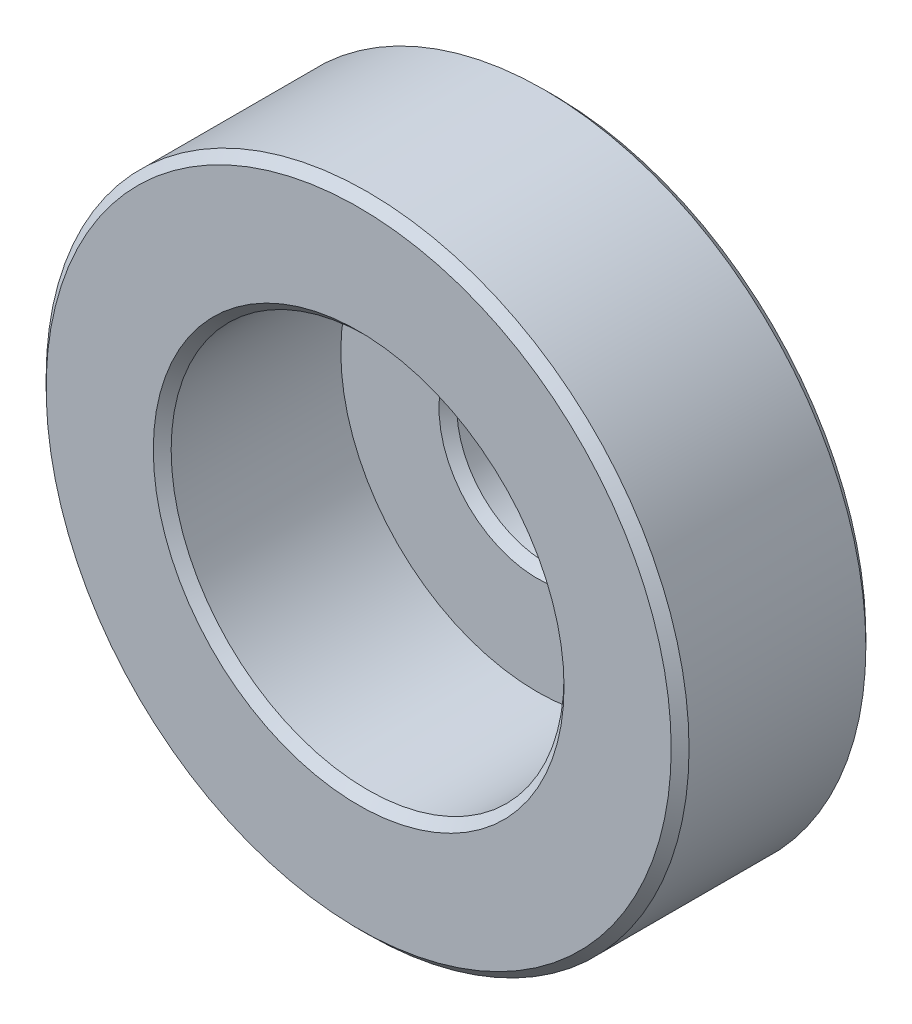
ISO-10303-21;
HEADER;
FILE_DESCRIPTION(('STEP AP214'),'2;1');
FILE_NAME('part.step','',(''),(''),'','','');
FILE_SCHEMA(('AUTOMOTIVE_DESIGN { 1 0 10303 214 1 1 1 1 }'));
ENDSEC;
DATA;
#1=APPLICATION_CONTEXT('core data for automotive mechanical design processes');
#2=APPLICATION_PROTOCOL_DEFINITION('international standard','automotive_design',2000,#1);
#3=PRODUCT_CONTEXT('',#1,'mechanical');
#4=PRODUCT('Part','Part','',(#3));
#5=PRODUCT_RELATED_PRODUCT_CATEGORY('part','',(#4));
#6=PRODUCT_DEFINITION_FORMATION('','',#4);
#7=PRODUCT_DEFINITION_CONTEXT('part definition',#1,'design');
#8=PRODUCT_DEFINITION('design','',#6,#7);
#9=PRODUCT_DEFINITION_SHAPE('','',#8);
#10=(LENGTH_UNIT() NAMED_UNIT(*) SI_UNIT(.MILLI.,.METRE.));
#11=(NAMED_UNIT(*) PLANE_ANGLE_UNIT() SI_UNIT($,.RADIAN.));
#12=(NAMED_UNIT(*) SI_UNIT($,.STERADIAN.) SOLID_ANGLE_UNIT());
#13=UNCERTAINTY_MEASURE_WITH_UNIT(LENGTH_MEASURE(1.E-05),#10,'distance_accuracy_value','');
#14=(GEOMETRIC_REPRESENTATION_CONTEXT(3) GLOBAL_UNCERTAINTY_ASSIGNED_CONTEXT((#13)) GLOBAL_UNIT_ASSIGNED_CONTEXT((#10,
#11,#12)) REPRESENTATION_CONTEXT('',''));
#15=CARTESIAN_POINT('',(0.,0.,0.));
#16=DIRECTION('',(0.,0.,1.));
#17=DIRECTION('',(1.,0.,0.));
#18=AXIS2_PLACEMENT_3D('',#15,#16,#17);
#19=CARTESIAN_POINT('',(-11.,0.,0.));
#20=DIRECTION('',(0.,0.,-1.));
#21=DIRECTION('',(-1.,0.,0.));
#22=AXIS2_PLACEMENT_3D('',#19,#20,#21);
#23=PLANE('',#22);
#24=DIRECTION('',(0.,1.,0.));
#25=VECTOR('',#24,1.);
#26=CARTESIAN_POINT('',(-1.25,-4.84122918275927,0.));
#27=LINE('',#26,#25);
#28=CARTESIAN_POINT('',(-1.25,-10.4253297309965,0.));
#29=VERTEX_POINT('',#28);
#30=CARTESIAN_POINT('',(-1.25,-4.84122918275927,0.));
#31=VERTEX_POINT('',#30);
#32=EDGE_CURVE('E133',#29,#31,#27,.T.);
#33=ORIENTED_EDGE('',*,*,#32,.F.);
#34=CARTESIAN_POINT('',(0.,0.,0.));
#35=DIRECTION('',(0.,0.,-1.));
#36=DIRECTION('',(-1.,0.,0.));
#37=AXIS2_PLACEMENT_3D('',#34,#35,#36);
#38=CIRCLE('',#37,10.5);
#39=CARTESIAN_POINT('',(-1.25,10.4253297309965,0.));
#40=VERTEX_POINT('',#39);
#41=EDGE_CURVE('E209',#29,#40,#38,.T.);
#42=ORIENTED_EDGE('',*,*,#41,.T.);
#43=DIRECTION('',(0.,1.,0.));
#44=VECTOR('',#43,1.);
#45=CARTESIAN_POINT('',(-1.25,10.9409689664164,0.));
#46=LINE('',#45,#44);
#47=CARTESIAN_POINT('',(-1.25,4.84122918275927,0.));
#48=VERTEX_POINT('',#47);
#49=EDGE_CURVE('E142',#48,#40,#46,.T.);
#50=ORIENTED_EDGE('',*,*,#49,.F.);
#51=CARTESIAN_POINT('',(0.,0.,0.));
#52=DIRECTION('',(0.,0.,-1.));
#53=DIRECTION('',(-1.,0.,0.));
#54=AXIS2_PLACEMENT_3D('',#51,#52,#53);
#55=CIRCLE('',#54,5.);
#56=EDGE_CURVE('E167',#31,#48,#55,.T.);
#57=ORIENTED_EDGE('',*,*,#56,.F.);
#58=EDGE_LOOP('',(#33,#42,#50,#57));
#59=FACE_BOUND('',#58,.T.);
#60=ADVANCED_FACE('F32',(#59),#23,.T.);
#61=CARTESIAN_POINT('',(-18.,0.,15.4));
#62=DIRECTION('',(0.,0.,1.));
#63=DIRECTION('',(1.,0.,0.));
#64=AXIS2_PLACEMENT_3D('',#61,#62,#63);
#65=PLANE('',#64);
#66=CARTESIAN_POINT('',(0.,0.,15.4));
#67=DIRECTION('',(0.,0.,1.));
#68=DIRECTION('',(1.,0.,0.));
#69=AXIS2_PLACEMENT_3D('',#66,#67,#68);
#70=CIRCLE('',#69,11.5);
#71=CARTESIAN_POINT('',(11.5,0.,15.4));
#72=VERTEX_POINT('',#71);
#73=EDGE_CURVE('E194',#72,#72,#70,.F.);
#74=ORIENTED_EDGE('',*,*,#73,.T.);
#75=EDGE_LOOP('',(#74));
#76=FACE_BOUND('',#75,.T.);
#77=CARTESIAN_POINT('',(0.,0.,15.4));
#78=DIRECTION('',(0.,0.,1.));
#79=DIRECTION('',(1.,0.,0.));
#80=AXIS2_PLACEMENT_3D('',#77,#78,#79);
#81=CIRCLE('',#80,17.5);
#82=CARTESIAN_POINT('',(17.5,0.,15.4));
#83=VERTEX_POINT('',#82);
#84=EDGE_CURVE('E191',#83,#83,#81,.T.);
#85=ORIENTED_EDGE('',*,*,#84,.T.);
#86=EDGE_LOOP('',(#85));
#87=FACE_BOUND('',#86,.T.);
#88=ADVANCED_FACE('F259',(#76,#87),#65,.T.);
#89=CARTESIAN_POINT('',(0.,0.,0.));
#90=DIRECTION('',(0.,0.,-1.));
#91=DIRECTION('',(-1.,0.,0.));
#92=AXIS2_PLACEMENT_3D('',#89,#90,#91);
#93=CYLINDRICAL_SURFACE('',#92,11.);
#94=CARTESIAN_POINT('',(0.,0.,14.9));
#95=DIRECTION('',(0.,0.,1.));
#96=DIRECTION('',(1.,0.,0.));
#97=AXIS2_PLACEMENT_3D('',#94,#95,#96);
#98=CIRCLE('',#97,11.);
#99=CARTESIAN_POINT('',(11.,0.,14.9));
#100=VERTEX_POINT('',#99);
#101=EDGE_CURVE('E197',#100,#100,#98,.T.);
#102=ORIENTED_EDGE('',*,*,#101,.T.);
#103=EDGE_LOOP('',(#102));
#104=FACE_BOUND('',#103,.T.);
#105=CARTESIAN_POINT('',(0.,0.,5.4));
#106=DIRECTION('',(0.,0.,-1.));
#107=DIRECTION('',(-1.,0.,0.));
#108=AXIS2_PLACEMENT_3D('',#105,#106,#107);
#109=CIRCLE('',#108,11.);
#110=CARTESIAN_POINT('',(-11.,0.,5.4));
#111=VERTEX_POINT('',#110);
#112=EDGE_CURVE('E169',#111,#111,#109,.T.);
#113=ORIENTED_EDGE('',*,*,#112,.T.);
#114=EDGE_LOOP('',(#113));
#115=FACE_BOUND('',#114,.T.);
#116=ADVANCED_FACE('F255',(#104,#115),#93,.F.);
#117=CARTESIAN_POINT('',(-11.,0.,5.4));
#118=DIRECTION('',(0.,0.,1.));
#119=DIRECTION('',(1.,0.,0.));
#120=AXIS2_PLACEMENT_3D('',#117,#118,#119);
#121=PLANE('',#120);
#122=CARTESIAN_POINT('',(0.,0.,5.4));
#123=DIRECTION('',(0.,0.,1.));
#124=DIRECTION('',(1.,0.,0.));
#125=AXIS2_PLACEMENT_3D('',#122,#123,#124);
#126=CIRCLE('',#125,5.49999999999998);
#127=CARTESIAN_POINT('',(5.49999999999999,0.,5.4));
#128=VERTEX_POINT('',#127);
#129=EDGE_CURVE('E185',#128,#128,#126,.F.);
#130=ORIENTED_EDGE('',*,*,#129,.T.);
#131=EDGE_LOOP('',(#130));
#132=FACE_BOUND('',#131,.T.);
#133=ORIENTED_EDGE('',*,*,#112,.F.);
#134=EDGE_LOOP('',(#133));
#135=FACE_BOUND('',#134,.T.);
#136=ADVANCED_FACE('F251',(#132,#135),#121,.T.);
#137=CARTESIAN_POINT('',(0.,0.,0.));
#138=DIRECTION('',(0.,0.,-1.));
#139=DIRECTION('',(-1.,0.,0.));
#140=AXIS2_PLACEMENT_3D('',#137,#138,#139);
#141=CYLINDRICAL_SURFACE('',#140,5.);
#142=CARTESIAN_POINT('',(0.,0.,4.90000000000001));
#143=DIRECTION('',(0.,0.,1.));
#144=DIRECTION('',(1.,0.,0.));
#145=AXIS2_PLACEMENT_3D('',#142,#143,#144);
#146=CIRCLE('',#145,5.);
#147=CARTESIAN_POINT('',(5.,0.,4.90000000000001));
#148=VERTEX_POINT('',#147);
#149=EDGE_CURVE('E188',#148,#148,#146,.T.);
#150=ORIENTED_EDGE('',*,*,#149,.T.);
#151=EDGE_LOOP('',(#150));
#152=FACE_BOUND('',#151,.T.);
#153=DIRECTION('',(0.,0.,-1.));
#154=VECTOR('',#153,1.);
#155=CARTESIAN_POINT('',(-1.25,-4.84122918275927,1.5));
#156=LINE('',#155,#154);
#157=CARTESIAN_POINT('',(-1.25,-4.84122918275927,1.5));
#158=VERTEX_POINT('',#157);
#159=EDGE_CURVE('E140',#158,#31,#156,.T.);
#160=ORIENTED_EDGE('',*,*,#159,.T.);
#161=ORIENTED_EDGE('',*,*,#56,.T.);
#162=DIRECTION('',(0.,0.,-1.));
#163=VECTOR('',#162,1.);
#164=CARTESIAN_POINT('',(-1.25,4.84122918275927,1.5));
#165=LINE('',#164,#163);
#166=CARTESIAN_POINT('',(-1.25,4.84122918275927,1.5));
#167=VERTEX_POINT('',#166);
#168=EDGE_CURVE('E156',#167,#48,#165,.T.);
#169=ORIENTED_EDGE('',*,*,#168,.F.);
#170=CARTESIAN_POINT('',(0.,0.,1.5));
#171=DIRECTION('',(0.,0.,1.));
#172=DIRECTION('',(-1.,0.,0.));
#173=AXIS2_PLACEMENT_3D('',#170,#171,#172);
#174=CIRCLE('',#173,5.);
#175=CARTESIAN_POINT('',(1.25,4.84122918275927,1.5));
#176=VERTEX_POINT('',#175);
#177=EDGE_CURVE('E147',#176,#167,#174,.T.);
#178=ORIENTED_EDGE('',*,*,#177,.F.);
#179=DIRECTION('',(0.,0.,-1.));
#180=VECTOR('',#179,1.);
#181=CARTESIAN_POINT('',(1.25,4.84122918275927,1.5));
#182=LINE('',#181,#180);
#183=CARTESIAN_POINT('',(1.25,4.84122918275927,0.));
#184=VERTEX_POINT('',#183);
#185=EDGE_CURVE('E160',#176,#184,#182,.T.);
#186=ORIENTED_EDGE('',*,*,#185,.T.);
#187=CARTESIAN_POINT('',(1.25,-4.84122918275927,0.));
#188=VERTEX_POINT('',#187);
#189=EDGE_CURVE('E139',#184,#188,#55,.T.);
#190=ORIENTED_EDGE('',*,*,#189,.T.);
#191=DIRECTION('',(0.,0.,-1.));
#192=VECTOR('',#191,1.);
#193=CARTESIAN_POINT('',(1.25,-4.84122918275927,1.5));
#194=LINE('',#193,#192);
#195=CARTESIAN_POINT('',(1.25,-4.84122918275927,1.5));
#196=VERTEX_POINT('',#195);
#197=EDGE_CURVE('E118',#196,#188,#194,.T.);
#198=ORIENTED_EDGE('',*,*,#197,.F.);
#199=CARTESIAN_POINT('',(0.,0.,1.5));
#200=DIRECTION('',(0.,0.,1.));
#201=DIRECTION('',(-1.,0.,0.));
#202=AXIS2_PLACEMENT_3D('',#199,#200,#201);
#203=CIRCLE('',#202,5.);
#204=EDGE_CURVE('E125',#158,#196,#203,.T.);
#205=ORIENTED_EDGE('',*,*,#204,.F.);
#206=EDGE_LOOP('',(#160,#161,#169,#178,#186,#190,#198,#205));
#207=FACE_BOUND('',#206,.T.);
#208=ADVANCED_FACE('F136',(#152,#207),#141,.F.);
#209=DIRECTION('',(0.,-1.,0.));
#210=VECTOR('',#209,1.);
#211=CARTESIAN_POINT('',(1.25,10.9409689664164,0.));
#212=LINE('',#211,#210);
#213=CARTESIAN_POINT('',(1.25,10.4253297309965,0.));
#214=VERTEX_POINT('',#213);
#215=EDGE_CURVE('E151',#214,#184,#212,.T.);
#216=ORIENTED_EDGE('',*,*,#215,.F.);
#217=CARTESIAN_POINT('',(0.,0.,0.));
#218=DIRECTION('',(0.,0.,-1.));
#219=DIRECTION('',(-1.,0.,0.));
#220=AXIS2_PLACEMENT_3D('',#217,#218,#219);
#221=CIRCLE('',#220,10.5);
#222=CARTESIAN_POINT('',(1.25,-10.4253297309965,0.));
#223=VERTEX_POINT('',#222);
#224=EDGE_CURVE('E308',#214,#223,#221,.T.);
#225=ORIENTED_EDGE('',*,*,#224,.T.);
#226=DIRECTION('',(0.,-1.,0.));
#227=VECTOR('',#226,1.);
#228=CARTESIAN_POINT('',(1.25,-4.84122918275927,0.));
#229=LINE('',#228,#227);
#230=EDGE_CURVE('E293',#188,#223,#229,.T.);
#231=ORIENTED_EDGE('',*,*,#230,.F.);
#232=ORIENTED_EDGE('',*,*,#189,.F.);
#233=EDGE_LOOP('',(#216,#225,#231,#232));
#234=FACE_BOUND('',#233,.T.);
#235=ADVANCED_FACE('F244',(#234),#23,.T.);
#236=CARTESIAN_POINT('',(0.,0.,0.));
#237=DIRECTION('',(0.,0.,-1.));
#238=DIRECTION('',(-1.,0.,0.));
#239=AXIS2_PLACEMENT_3D('',#236,#237,#238);
#240=CYLINDRICAL_SURFACE('',#239,11.);
#241=DIRECTION('',(0.,0.,-1.));
#242=VECTOR('',#241,1.);
#243=CARTESIAN_POINT('',(-1.25,10.9287464971972,0.));
#244=LINE('',#243,#242);
#245=CARTESIAN_POINT('',(-1.25,10.9287464971972,0.499999999999997));
#246=VERTEX_POINT('',#245);
#247=CARTESIAN_POINT('',(-1.25,10.9287464971972,1.5));
#248=VERTEX_POINT('',#247);
#249=EDGE_CURVE('E175',#246,#248,#244,.F.);
#250=ORIENTED_EDGE('',*,*,#249,.F.);
#251=CARTESIAN_POINT('',(0.,0.,0.499999999999997));
#252=DIRECTION('',(0.,0.,-1.));
#253=DIRECTION('',(-1.,0.,0.));
#254=AXIS2_PLACEMENT_3D('',#251,#252,#253);
#255=CIRCLE('',#254,11.);
#256=CARTESIAN_POINT('',(-1.25,-10.9287464971972,0.499999999999997));
#257=VERTEX_POINT('',#256);
#258=EDGE_CURVE('E297',#246,#257,#255,.F.);
#259=ORIENTED_EDGE('',*,*,#258,.T.);
#260=DIRECTION('',(0.,0.,-1.));
#261=VECTOR('',#260,1.);
#262=CARTESIAN_POINT('',(-1.25,-10.9287464971972,0.));
#263=LINE('',#262,#261);
#264=CARTESIAN_POINT('',(-1.25,-10.9287464971972,1.5));
#265=VERTEX_POINT('',#264);
#266=EDGE_CURVE('E182',#265,#257,#263,.T.);
#267=ORIENTED_EDGE('',*,*,#266,.F.);
#268=CARTESIAN_POINT('',(0.,0.,1.5));
#269=DIRECTION('',(0.,0.,-1.));
#270=DIRECTION('',(-1.,0.,0.));
#271=AXIS2_PLACEMENT_3D('',#268,#269,#270);
#272=CIRCLE('',#271,11.);
#273=CARTESIAN_POINT('',(1.25,-10.9287464971972,1.5));
#274=VERTEX_POINT('',#273);
#275=EDGE_CURVE('E179',#265,#274,#272,.F.);
#276=ORIENTED_EDGE('',*,*,#275,.T.);
#277=DIRECTION('',(0.,0.,-1.));
#278=VECTOR('',#277,1.);
#279=CARTESIAN_POINT('',(1.25,-10.9287464971972,0.));
#280=LINE('',#279,#278);
#281=CARTESIAN_POINT('',(1.25,-10.9287464971972,0.5));
#282=VERTEX_POINT('',#281);
#283=EDGE_CURVE('E121',#282,#274,#280,.F.);
#284=ORIENTED_EDGE('',*,*,#283,.F.);
#285=CARTESIAN_POINT('',(0.,0.,0.500000000000001));
#286=DIRECTION('',(0.,0.,-1.));
#287=DIRECTION('',(-1.,0.,0.));
#288=AXIS2_PLACEMENT_3D('',#285,#286,#287);
#289=CIRCLE('',#288,11.);
#290=CARTESIAN_POINT('',(1.25,10.9287464971972,0.5));
#291=VERTEX_POINT('',#290);
#292=EDGE_CURVE('E219',#282,#291,#289,.F.);
#293=ORIENTED_EDGE('',*,*,#292,.T.);
#294=DIRECTION('',(0.,0.,-1.));
#295=VECTOR('',#294,1.);
#296=CARTESIAN_POINT('',(1.25,10.9287464971972,0.));
#297=LINE('',#296,#295);
#298=CARTESIAN_POINT('',(1.25,10.9287464971972,1.5));
#299=VERTEX_POINT('',#298);
#300=EDGE_CURVE('E177',#299,#291,#297,.T.);
#301=ORIENTED_EDGE('',*,*,#300,.F.);
#302=CARTESIAN_POINT('',(0.,0.,1.5));
#303=DIRECTION('',(0.,0.,-1.));
#304=DIRECTION('',(-1.,0.,0.));
#305=AXIS2_PLACEMENT_3D('',#302,#303,#304);
#306=CIRCLE('',#305,11.);
#307=EDGE_CURVE('E172',#299,#248,#306,.F.);
#308=ORIENTED_EDGE('',*,*,#307,.T.);
#309=EDGE_LOOP('',(#250,#259,#267,#276,#284,#293,#301,#308));
#310=FACE_BOUND('',#309,.T.);
#311=CARTESIAN_POINT('',(0.,0.,4.5));
#312=DIRECTION('',(0.,0.,-1.));
#313=DIRECTION('',(-1.,0.,0.));
#314=AXIS2_PLACEMENT_3D('',#311,#312,#313);
#315=CIRCLE('',#314,11.);
#316=CARTESIAN_POINT('',(-11.,0.,4.5));
#317=VERTEX_POINT('',#316);
#318=EDGE_CURVE('E162',#317,#317,#315,.T.);
#319=ORIENTED_EDGE('',*,*,#318,.T.);
#320=EDGE_LOOP('',(#319));
#321=FACE_BOUND('',#320,.T.);
#322=ADVANCED_FACE('F240',(#310,#321),#240,.T.);
#323=CARTESIAN_POINT('',(-18.,0.,4.5));
#324=DIRECTION('',(0.,0.,-1.));
#325=DIRECTION('',(-1.,0.,0.));
#326=AXIS2_PLACEMENT_3D('',#323,#324,#325);
#327=PLANE('',#326);
#328=CARTESIAN_POINT('',(0.,0.,4.5));
#329=DIRECTION('',(0.,0.,-1.));
#330=DIRECTION('',(-1.,0.,0.));
#331=AXIS2_PLACEMENT_3D('',#328,#329,#330);
#332=CIRCLE('',#331,17.5);
#333=CARTESIAN_POINT('',(-17.5,0.,4.5));
#334=VERTEX_POINT('',#333);
#335=EDGE_CURVE('E206',#334,#334,#332,.T.);
#336=ORIENTED_EDGE('',*,*,#335,.T.);
#337=EDGE_LOOP('',(#336));
#338=FACE_BOUND('',#337,.T.);
#339=ORIENTED_EDGE('',*,*,#318,.F.);
#340=EDGE_LOOP('',(#339));
#341=FACE_BOUND('',#340,.T.);
#342=ADVANCED_FACE('F236',(#338,#341),#327,.T.);
#343=CARTESIAN_POINT('',(0.,0.,0.));
#344=DIRECTION('',(0.,0.,-1.));
#345=DIRECTION('',(-1.,0.,0.));
#346=AXIS2_PLACEMENT_3D('',#343,#344,#345);
#347=CYLINDRICAL_SURFACE('',#346,18.);
#348=CARTESIAN_POINT('',(0.,0.,14.9));
#349=DIRECTION('',(0.,0.,1.));
#350=DIRECTION('',(1.,0.,0.));
#351=AXIS2_PLACEMENT_3D('',#348,#349,#350);
#352=CIRCLE('',#351,18.);
#353=CARTESIAN_POINT('',(18.,0.,14.9));
#354=VERTEX_POINT('',#353);
#355=EDGE_CURVE('E203',#354,#354,#352,.F.);
#356=ORIENTED_EDGE('',*,*,#355,.T.);
#357=EDGE_LOOP('',(#356));
#358=FACE_BOUND('',#357,.T.);
#359=CARTESIAN_POINT('',(0.,0.,4.99999999999999));
#360=DIRECTION('',(0.,0.,-1.));
#361=DIRECTION('',(-1.,0.,0.));
#362=AXIS2_PLACEMENT_3D('',#359,#360,#361);
#363=CIRCLE('',#362,18.);
#364=CARTESIAN_POINT('',(-18.,0.,4.99999999999999));
#365=VERTEX_POINT('',#364);
#366=EDGE_CURVE('E200',#365,#365,#363,.F.);
#367=ORIENTED_EDGE('',*,*,#366,.T.);
#368=EDGE_LOOP('',(#367));
#369=FACE_BOUND('',#368,.T.);
#370=ADVANCED_FACE('F233',(#358,#369),#347,.T.);
#371=CARTESIAN_POINT('',(1.25,10.9409689664164,1.5));
#372=DIRECTION('',(1.,0.,0.));
#373=DIRECTION('',(0.,0.,-1.));
#374=AXIS2_PLACEMENT_3D('',#371,#372,#373);
#375=PLANE('',#374);
#376=ORIENTED_EDGE('',*,*,#300,.T.);
#377=CARTESIAN_POINT('',(1.25,10.9287464971972,0.5));
#378=CARTESIAN_POINT('',(1.25,10.8448569910639,0.416653287652448));
#379=CARTESIAN_POINT('',(1.25,10.76096084082,0.333313264818164));
#380=CARTESIAN_POINT('',(1.25,10.5931552520865,0.166646598151493));
#381=CARTESIAN_POINT('',(1.25,10.5092458135968,0.0833199543191108));
#382=CARTESIAN_POINT('',(1.25,10.4253297309965,0.));
#383=B_SPLINE_CURVE_WITH_KNOTS('',3,(#377,#378,#379,#380,#381,#382),.UNSPECIFIED.,.F.,.F.,(4,2,
4),(0.,0.354763457652868,0.709526915410628),.UNSPECIFIED.);
#384=EDGE_CURVE('E11',#291,#214,#383,.T.);
#385=ORIENTED_EDGE('',*,*,#384,.T.);
#386=ORIENTED_EDGE('',*,*,#215,.T.);
#387=ORIENTED_EDGE('',*,*,#185,.F.);
#388=DIRECTION('',(0.,-1.,0.));
#389=VECTOR('',#388,1.);
#390=CARTESIAN_POINT('',(1.25,10.9409689664164,1.5));
#391=LINE('',#390,#389);
#392=EDGE_CURVE('E154',#299,#176,#391,.T.);
#393=ORIENTED_EDGE('',*,*,#392,.F.);
#394=EDGE_LOOP('',(#376,#385,#386,#387,#393));
#395=FACE_BOUND('',#394,.T.);
#396=ADVANCED_FACE('F229',(#395),#375,.F.);
#397=CARTESIAN_POINT('',(-1.25,10.9409689664164,1.5));
#398=DIRECTION('',(-1.,0.,0.));
#399=DIRECTION('',(0.,0.,1.));
#400=AXIS2_PLACEMENT_3D('',#397,#398,#399);
#401=PLANE('',#400);
#402=ORIENTED_EDGE('',*,*,#49,.T.);
#403=CARTESIAN_POINT('',(-1.25,10.4253297309965,0.));
#404=CARTESIAN_POINT('',(-1.25,10.5092458135968,0.0833199543191108));
#405=CARTESIAN_POINT('',(-1.25,10.5931552520865,0.166646598151493));
#406=CARTESIAN_POINT('',(-1.25,10.76096084082,0.333313264818163));
#407=CARTESIAN_POINT('',(-1.25,10.8448569910639,0.416653287652446));
#408=CARTESIAN_POINT('',(-1.25,10.9287464971972,0.499999999999997));
#409=B_SPLINE_CURVE_WITH_KNOTS('',3,(#403,#404,#405,#406,#407,#408),.UNSPECIFIED.,.F.,.F.,(4,2,
4),(0.,0.354763457757757,0.709526915410622),.UNSPECIFIED.);
#410=EDGE_CURVE('E212',#40,#246,#409,.T.);
#411=ORIENTED_EDGE('',*,*,#410,.T.);
#412=ORIENTED_EDGE('',*,*,#249,.T.);
#413=DIRECTION('',(0.,1.,0.));
#414=VECTOR('',#413,1.);
#415=CARTESIAN_POINT('',(-1.25,10.9409689664164,1.5));
#416=LINE('',#415,#414);
#417=EDGE_CURVE('E150',#167,#248,#416,.T.);
#418=ORIENTED_EDGE('',*,*,#417,.F.);
#419=ORIENTED_EDGE('',*,*,#168,.T.);
#420=EDGE_LOOP('',(#402,#411,#412,#418,#419));
#421=FACE_BOUND('',#420,.T.);
#422=ADVANCED_FACE('F224',(#421),#401,.F.);
#423=CARTESIAN_POINT('',(0.,0.,1.5));
#424=DIRECTION('',(0.,0.,-1.));
#425=DIRECTION('',(-1.,0.,0.));
#426=AXIS2_PLACEMENT_3D('',#423,#424,#425);
#427=PLANE('',#426);
#428=ORIENTED_EDGE('',*,*,#392,.T.);
#429=ORIENTED_EDGE('',*,*,#177,.T.);
#430=ORIENTED_EDGE('',*,*,#417,.T.);
#431=ORIENTED_EDGE('',*,*,#307,.F.);
#432=EDGE_LOOP('',(#428,#429,#430,#431));
#433=FACE_BOUND('',#432,.T.);
#434=ADVANCED_FACE('F228',(#433),#427,.T.);
#435=CARTESIAN_POINT('',(-1.25,-4.84122918275927,1.5));
#436=DIRECTION('',(-1.,0.,0.));
#437=DIRECTION('',(0.,0.,1.));
#438=AXIS2_PLACEMENT_3D('',#435,#436,#437);
#439=PLANE('',#438);
#440=ORIENTED_EDGE('',*,*,#266,.T.);
#441=CARTESIAN_POINT('',(-1.25,-10.9287464971972,0.499999999999997));
#442=CARTESIAN_POINT('',(-1.25,-10.8448569910639,0.416653287652446));
#443=CARTESIAN_POINT('',(-1.25,-10.76096084082,0.333313264818162));
#444=CARTESIAN_POINT('',(-1.25,-10.5931552520865,0.166646598151493));
#445=CARTESIAN_POINT('',(-1.25,-10.5092458135968,0.0833199543191116));
#446=CARTESIAN_POINT('',(-1.25,-10.4253297309965,0.));
#447=B_SPLINE_CURVE_WITH_KNOTS('',3,(#441,#442,#443,#444,#445,#446),.UNSPECIFIED.,.F.,.F.,(4,2,
4),(0.,0.354763457652867,0.709526915410622),.UNSPECIFIED.);
#448=EDGE_CURVE('E296',#257,#29,#447,.T.);
#449=ORIENTED_EDGE('',*,*,#448,.T.);
#450=ORIENTED_EDGE('',*,*,#32,.T.);
#451=ORIENTED_EDGE('',*,*,#159,.F.);
#452=DIRECTION('',(0.,1.,0.));
#453=VECTOR('',#452,1.);
#454=CARTESIAN_POINT('',(-1.25,-4.84122918275927,1.5));
#455=LINE('',#454,#453);
#456=EDGE_CURVE('E124',#265,#158,#455,.T.);
#457=ORIENTED_EDGE('',*,*,#456,.F.);
#458=EDGE_LOOP('',(#440,#449,#450,#451,#457));
#459=FACE_BOUND('',#458,.T.);
#460=ADVANCED_FACE('F307',(#459),#439,.F.);
#461=CARTESIAN_POINT('',(1.25,-4.84122918275927,1.5));
#462=DIRECTION('',(1.,0.,0.));
#463=DIRECTION('',(0.,0.,-1.));
#464=AXIS2_PLACEMENT_3D('',#461,#462,#463);
#465=PLANE('',#464);
#466=ORIENTED_EDGE('',*,*,#230,.T.);
#467=CARTESIAN_POINT('',(1.25,-10.4253297309965,0.));
#468=CARTESIAN_POINT('',(1.25,-10.5092458135968,0.0833199543191107));
#469=CARTESIAN_POINT('',(1.25,-10.5931552520865,0.166646598151493));
#470=CARTESIAN_POINT('',(1.25,-10.76096084082,0.333313264818164));
#471=CARTESIAN_POINT('',(1.25,-10.8448569910639,0.416653287652448));
#472=CARTESIAN_POINT('',(1.25,-10.9287464971972,0.5));
#473=B_SPLINE_CURVE_WITH_KNOTS('',3,(#467,#468,#469,#470,#471,#472),.UNSPECIFIED.,.F.,.F.,(4,2,
4),(0.,0.35476345775776,0.709526915410629),.UNSPECIFIED.);
#474=EDGE_CURVE('E46',#223,#282,#473,.T.);
#475=ORIENTED_EDGE('',*,*,#474,.T.);
#476=ORIENTED_EDGE('',*,*,#283,.T.);
#477=DIRECTION('',(0.,-1.,0.));
#478=VECTOR('',#477,1.);
#479=CARTESIAN_POINT('',(1.25,-4.84122918275927,1.5));
#480=LINE('',#479,#478);
#481=EDGE_CURVE('E113',#196,#274,#480,.T.);
#482=ORIENTED_EDGE('',*,*,#481,.F.);
#483=ORIENTED_EDGE('',*,*,#197,.T.);
#484=EDGE_LOOP('',(#466,#475,#476,#482,#483));
#485=FACE_BOUND('',#484,.T.);
#486=ADVANCED_FACE('F116',(#485),#465,.F.);
#487=CARTESIAN_POINT('',(0.,0.,1.5));
#488=DIRECTION('',(0.,0.,-1.));
#489=DIRECTION('',(-1.,0.,0.));
#490=AXIS2_PLACEMENT_3D('',#487,#488,#489);
#491=PLANE('',#490);
#492=ORIENTED_EDGE('',*,*,#456,.T.);
#493=ORIENTED_EDGE('',*,*,#204,.T.);
#494=ORIENTED_EDGE('',*,*,#481,.T.);
#495=ORIENTED_EDGE('',*,*,#275,.F.);
#496=EDGE_LOOP('',(#492,#493,#494,#495));
#497=FACE_BOUND('',#496,.T.);
#498=ADVANCED_FACE('F128',(#497),#491,.T.);
#499=CARTESIAN_POINT('',(0.,0.,5.4));
#500=DIRECTION('',(0.,0.,1.));
#501=DIRECTION('',(1.,0.,0.));
#502=AXIS2_PLACEMENT_3D('',#499,#500,#501);
#503=CONICAL_SURFACE('',#502,5.49999999999998,0.785398163397444);
#504=ORIENTED_EDGE('',*,*,#149,.F.);
#505=EDGE_LOOP('',(#504));
#506=FACE_BOUND('',#505,.T.);
#507=ORIENTED_EDGE('',*,*,#129,.F.);
#508=EDGE_LOOP('',(#507));
#509=FACE_BOUND('',#508,.T.);
#510=ADVANCED_FACE('F264',(#506,#509),#503,.F.);
#511=CARTESIAN_POINT('',(0.,0.,15.4));
#512=DIRECTION('',(0.,0.,1.));
#513=DIRECTION('',(1.,0.,0.));
#514=AXIS2_PLACEMENT_3D('',#511,#512,#513);
#515=CONICAL_SURFACE('',#514,11.5,0.785398163397445);
#516=ORIENTED_EDGE('',*,*,#101,.F.);
#517=EDGE_LOOP('',(#516));
#518=FACE_BOUND('',#517,.T.);
#519=ORIENTED_EDGE('',*,*,#73,.F.);
#520=EDGE_LOOP('',(#519));
#521=FACE_BOUND('',#520,.T.);
#522=ADVANCED_FACE('F267',(#518,#521),#515,.F.);
#523=CARTESIAN_POINT('',(0.,0.,14.9));
#524=DIRECTION('',(0.,0.,-1.));
#525=DIRECTION('',(-1.,0.,0.));
#526=AXIS2_PLACEMENT_3D('',#523,#524,#525);
#527=CONICAL_SURFACE('',#526,18.,0.785398163397452);
#528=ORIENTED_EDGE('',*,*,#84,.F.);
#529=EDGE_LOOP('',(#528));
#530=FACE_BOUND('',#529,.T.);
#531=ORIENTED_EDGE('',*,*,#355,.F.);
#532=EDGE_LOOP('',(#531));
#533=FACE_BOUND('',#532,.T.);
#534=ADVANCED_FACE('F271',(#530,#533),#527,.T.);
#535=CARTESIAN_POINT('',(0.,0.,4.5));
#536=DIRECTION('',(0.,0.,1.));
#537=DIRECTION('',(1.,0.,0.));
#538=AXIS2_PLACEMENT_3D('',#535,#536,#537);
#539=CONICAL_SURFACE('',#538,17.5,0.785398163397452);
#540=ORIENTED_EDGE('',*,*,#366,.F.);
#541=EDGE_LOOP('',(#540));
#542=FACE_BOUND('',#541,.T.);
#543=ORIENTED_EDGE('',*,*,#335,.F.);
#544=EDGE_LOOP('',(#543));
#545=FACE_BOUND('',#544,.T.);
#546=ADVANCED_FACE('F274',(#542,#545),#539,.T.);
#547=CARTESIAN_POINT('',(0.,0.,0.));
#548=DIRECTION('',(0.,0.,1.));
#549=DIRECTION('',(1.,0.,0.));
#550=AXIS2_PLACEMENT_3D('',#547,#548,#549);
#551=CONICAL_SURFACE('',#550,10.5,0.785398163397447);
#552=ORIENTED_EDGE('',*,*,#448,.F.);
#553=ORIENTED_EDGE('',*,*,#258,.F.);
#554=ORIENTED_EDGE('',*,*,#410,.F.);
#555=ORIENTED_EDGE('',*,*,#41,.F.);
#556=EDGE_LOOP('',(#552,#553,#554,#555));
#557=FACE_BOUND('',#556,.T.);
#558=ADVANCED_FACE('F221',(#557),#551,.T.);
#559=CARTESIAN_POINT('',(0.,0.,0.));
#560=DIRECTION('',(0.,0.,1.));
#561=DIRECTION('',(1.,0.,0.));
#562=AXIS2_PLACEMENT_3D('',#559,#560,#561);
#563=CONICAL_SURFACE('',#562,10.5,0.785398163397446);
#564=ORIENTED_EDGE('',*,*,#384,.F.);
#565=ORIENTED_EDGE('',*,*,#292,.F.);
#566=ORIENTED_EDGE('',*,*,#474,.F.);
#567=ORIENTED_EDGE('',*,*,#224,.F.);
#568=EDGE_LOOP('',(#564,#565,#566,#567));
#569=FACE_BOUND('',#568,.T.);
#570=ADVANCED_FACE('F34',(#569),#563,.T.);
#571=CLOSED_SHELL('',(#60,#88,#116,#136,#208,#235,#322,#342,#370,#396,#422,#434,#460,#486,#498,
#510,#522,#534,#546,#558,#570));
#572=MANIFOLD_SOLID_BREP('B2',#571);
#573=ADVANCED_BREP_SHAPE_REPRESENTATION('',(#18,#572),#14);
#574=SHAPE_DEFINITION_REPRESENTATION(#9,#573);
ENDSEC;
END-ISO-10303-21;
